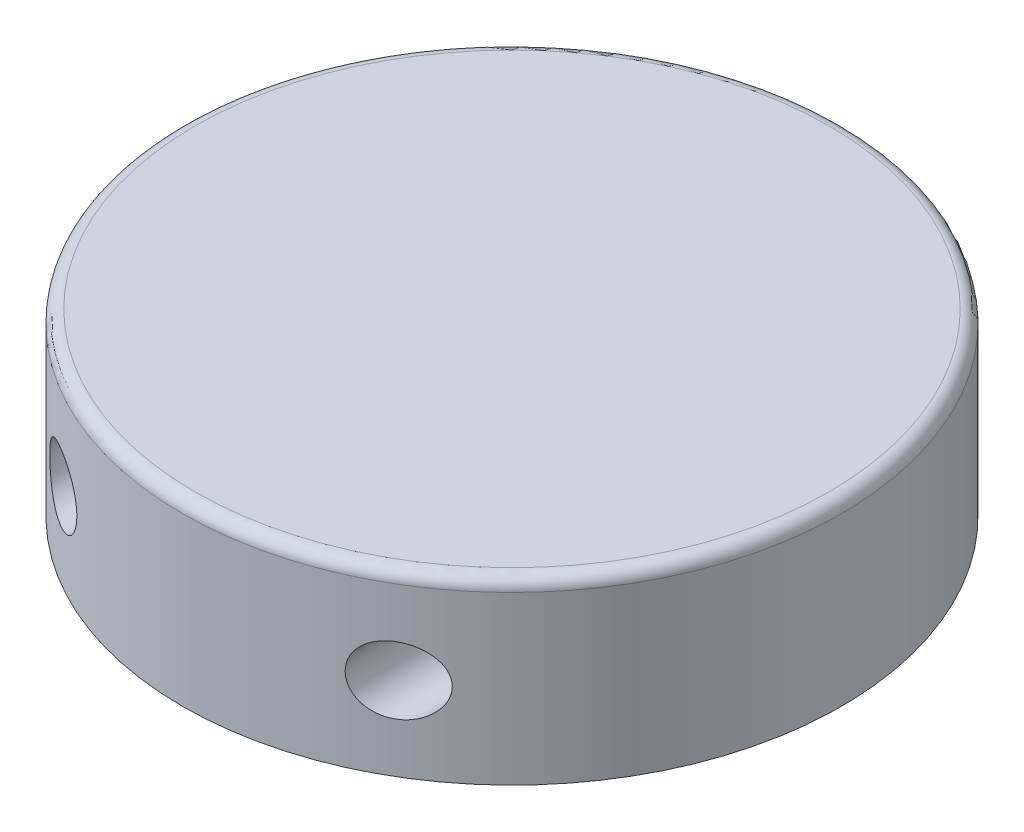
ISO-10303-21;
HEADER;
FILE_DESCRIPTION(('STEP AP214'),'2;1');
FILE_NAME('part.step','',(''),(''),'','','');
FILE_SCHEMA(('AUTOMOTIVE_DESIGN { 1 0 10303 214 1 1 1 1 }'));
ENDSEC;
DATA;
#1=APPLICATION_CONTEXT('core data for automotive mechanical design processes');
#2=APPLICATION_PROTOCOL_DEFINITION('international standard','automotive_design',2000,#1);
#3=PRODUCT_CONTEXT('',#1,'mechanical');
#4=PRODUCT('Part','Part','',(#3));
#5=PRODUCT_RELATED_PRODUCT_CATEGORY('part','',(#4));
#6=PRODUCT_DEFINITION_FORMATION('','',#4);
#7=PRODUCT_DEFINITION_CONTEXT('part definition',#1,'design');
#8=PRODUCT_DEFINITION('design','',#6,#7);
#9=PRODUCT_DEFINITION_SHAPE('','',#8);
#10=(LENGTH_UNIT() NAMED_UNIT(*) SI_UNIT(.MILLI.,.METRE.));
#11=(NAMED_UNIT(*) PLANE_ANGLE_UNIT() SI_UNIT($,.RADIAN.));
#12=(NAMED_UNIT(*) SI_UNIT($,.STERADIAN.) SOLID_ANGLE_UNIT());
#13=UNCERTAINTY_MEASURE_WITH_UNIT(LENGTH_MEASURE(1.E-05),#10,'distance_accuracy_value','');
#14=(GEOMETRIC_REPRESENTATION_CONTEXT(3) GLOBAL_UNCERTAINTY_ASSIGNED_CONTEXT((#13)) GLOBAL_UNIT_ASSIGNED_CONTEXT((#10,
#11,#12)) REPRESENTATION_CONTEXT('',''));
#15=CARTESIAN_POINT('',(0.,0.,0.));
#16=DIRECTION('',(0.,0.,1.));
#17=DIRECTION('',(1.,0.,0.));
#18=AXIS2_PLACEMENT_3D('',#15,#16,#17);
#19=CARTESIAN_POINT('',(0.,21.4,0.));
#20=DIRECTION('',(0.,-1.,0.));
#21=DIRECTION('',(0.,0.,-1.));
#22=AXIS2_PLACEMENT_3D('',#19,#20,#21);
#23=CYLINDRICAL_SURFACE('',#22,39.3);
#24=CARTESIAN_POINT('',(24.,9.94999999999997,31.1205719741781));
#25=CARTESIAN_POINT('',(24.0000004367337,9.75702235025103,31.1205716483451));
#26=CARTESIAN_POINT('',(23.9859498878768,9.56404571600808,31.1314224845735));
#27=CARTESIAN_POINT('',(23.9307323153177,9.18437149414656,31.1738868124886));
#28=CARTESIAN_POINT('',(23.889554633807,8.99767640475851,31.2055084646763));
#29=CARTESIAN_POINT('',(23.7829266022278,8.63670399423492,31.2868473359323));
#30=CARTESIAN_POINT('',(23.7175976432236,8.46236968013503,31.3364740337929));
#31=CARTESIAN_POINT('',(23.56591285891,8.12848015842301,31.4507032763606));
#32=CARTESIAN_POINT('',(23.4795504893609,7.9689295719222,31.5153104817342));
#33=CARTESIAN_POINT('',(23.2810537998613,7.65386834507642,31.6622644846472));
#34=CARTESIAN_POINT('',(23.1673608424185,7.49983155229876,31.7456474743854));
#35=CARTESIAN_POINT('',(22.9228514518291,7.21274960495519,31.9226517859381));
#36=CARTESIAN_POINT('',(22.7920271726797,7.0797141307694,32.016277795718));
#37=CARTESIAN_POINT('',(22.4886637812432,6.81065461097024,32.2302796034445));
#38=CARTESIAN_POINT('',(22.3130230727105,6.6793937134958,32.3522518750715));
#39=CARTESIAN_POINT('',(21.94598573118,6.44854278442323,32.6023487306357));
#40=CARTESIAN_POINT('',(21.7545776645915,6.34897599464994,32.7304777505384));
#41=CARTESIAN_POINT('',(21.3275209999802,6.16848395247953,33.0106375022933));
#42=CARTESIAN_POINT('',(21.0897588773783,6.09327668944546,33.1631480130952));
#43=CARTESIAN_POINT('',(20.6036253190854,5.98799899532425,33.4673383585911));
#44=CARTESIAN_POINT('',(20.3552486839697,5.95795095186154,33.6190177441569));
#45=CARTESIAN_POINT('',(19.9725838712759,5.94790055574151,33.8468582559754));
#46=CARTESIAN_POINT('',(19.8396864734694,5.95098780086743,33.9249249843817));
#47=CARTESIAN_POINT('',(19.573739423672,5.97054550202568,34.0790591570475));
#48=CARTESIAN_POINT('',(19.4406898587151,5.98701035463219,34.1551274246252));
#49=CARTESIAN_POINT('',(19.1754853954293,6.03358426834627,34.3047221863499));
#50=CARTESIAN_POINT('',(19.0433308395354,6.06369828204682,34.378247747445));
#51=CARTESIAN_POINT('',(18.7812618906078,6.13775619152729,34.5221164375005));
#52=CARTESIAN_POINT('',(18.6513462566428,6.18169214819713,34.5924613669044));
#53=CARTESIAN_POINT('',(18.403090890259,6.28031524591406,34.7251321387838));
#54=CARTESIAN_POINT('',(18.2845359828487,6.3341559146246,34.7876842490207));
#55=CARTESIAN_POINT('',(18.0518201313635,6.45404308371528,34.9090102518675));
#56=CARTESIAN_POINT('',(17.9376568140551,6.52008287641596,34.9677861969774));
#57=CARTESIAN_POINT('',(17.715029480331,6.66419947243356,35.0810964499967));
#58=CARTESIAN_POINT('',(17.6065629619296,6.74227093125897,35.1356326251172));
#59=CARTESIAN_POINT('',(17.3966771906184,6.91013825072774,35.2400249478298));
#60=CARTESIAN_POINT('',(17.2952568268871,6.9999322568638,35.2898818335456));
#61=CARTESIAN_POINT('',(17.1129078985375,7.17890877820417,35.3786286616791));
#62=CARTESIAN_POINT('',(17.0309955888393,7.26679676310176,35.4181125613419));
#63=CARTESIAN_POINT('',(16.8746549624477,7.45064549013117,35.4928658601843));
#64=CARTESIAN_POINT('',(16.8002255303775,7.54660502521217,35.5281358876201));
#65=CARTESIAN_POINT('',(16.6598301750251,7.74588712005912,35.5941860126814));
#66=CARTESIAN_POINT('',(16.5938592250628,7.84920524945849,35.6249687784863));
#67=CARTESIAN_POINT('',(16.4712229092875,8.0624474489991,35.6818355493655));
#68=CARTESIAN_POINT('',(16.4145565690073,8.1723708257268,35.7079200465151));
#69=CARTESIAN_POINT('',(16.3171344455011,8.38519331690116,35.752533659173));
#70=CARTESIAN_POINT('',(16.2753064246444,8.48749432657372,35.771582347638));
#71=CARTESIAN_POINT('',(16.2001015603304,8.69579534509265,35.8057036879036));
#72=CARTESIAN_POINT('',(16.1667238642029,8.80179497950456,35.8207767408674));
#73=CARTESIAN_POINT('',(16.1088299521118,9.01663562301356,35.8468493261039));
#74=CARTESIAN_POINT('',(16.0843105371636,9.12547559112743,35.8578503289485));
#75=CARTESIAN_POINT('',(16.0444189603798,9.34515368114454,35.875717412209));
#76=CARTESIAN_POINT('',(16.0290464721834,9.45599173161113,35.8825836401532));
#77=CARTESIAN_POINT('',(16.0083463654044,9.67138845944432,35.8918230870908));
#78=CARTESIAN_POINT('',(16.0024229313056,9.77587895581515,35.8944628533587));
#79=CARTESIAN_POINT('',(15.9987856528215,9.98506750787086,35.8960842204553));
#80=CARTESIAN_POINT('',(16.0010744970963,10.0897656203137,35.895064623226));
#81=CARTESIAN_POINT('',(16.0138399684754,10.2985058317393,35.88937137729));
#82=CARTESIAN_POINT('',(16.0243123199287,10.4025482446997,35.8846996367243));
#83=CARTESIAN_POINT('',(16.0533286748346,10.6093095676124,35.871728285886));
#84=CARTESIAN_POINT('',(16.0718756602008,10.7120279741747,35.8634273353634));
#85=CARTESIAN_POINT('',(16.1164701809595,10.9136783936685,35.843409104268));
#86=CARTESIAN_POINT('',(16.1423877682993,11.012644970687,35.8317509714357));
#87=CARTESIAN_POINT('',(16.2015639810518,11.2078991889282,35.8050327728986));
#88=CARTESIAN_POINT('',(16.2348252241386,11.3041858610725,35.7899714940845));
#89=CARTESIAN_POINT('',(16.3451337594465,11.5880000960856,35.7397981726284));
#90=CARTESIAN_POINT('',(16.4327499466903,11.7706785711117,35.6996771156622));
#91=CARTESIAN_POINT('',(16.6355260115283,12.1232214652335,35.6056461831859));
#92=CARTESIAN_POINT('',(16.7513931649307,12.2925790300543,35.5513792568576));
#93=CARTESIAN_POINT('',(17.0049978429257,12.6091553448522,35.4307738955639));
#94=CARTESIAN_POINT('',(17.1427405334429,12.7563688494633,35.3644326086877));
#95=CARTESIAN_POINT('',(17.4455511320463,13.035455861771,35.2160901602475));
#96=CARTESIAN_POINT('',(17.6118433547985,13.1655925902241,35.1333284721708));
#97=CARTESIAN_POINT('',(17.9587281337197,13.3962512310725,34.9572874761152));
#98=CARTESIAN_POINT('',(18.1393260825743,13.4967619075816,34.8640041962468));
#99=CARTESIAN_POINT('',(18.5285877848544,13.6763135902414,34.6588303591607));
#100=CARTESIAN_POINT('',(18.7382407173076,13.7521451393071,34.5460121515003));
#101=CARTESIAN_POINT('',(19.1628838342106,13.8676166385126,34.3122826126043));
#102=CARTESIAN_POINT('',(19.3778762597849,13.9072411185971,34.191367845642));
#103=CARTESIAN_POINT('',(19.8331708788641,13.9538002472475,33.9295143068437));
#104=CARTESIAN_POINT('',(20.07351691554,13.9564111346466,33.7878795024511));
#105=CARTESIAN_POINT('',(20.5488041126521,13.9193469252747,33.5009534082908));
#106=CARTESIAN_POINT('',(20.7837413224327,13.8796418627614,33.3556595986066));
#107=CARTESIAN_POINT('',(21.2638434376475,13.7539124791498,33.0518791894045));
#108=CARTESIAN_POINT('',(21.5080015434858,13.6640115305599,32.8933919704275));
#109=CARTESIAN_POINT('',(21.9771466624118,13.4369427129619,32.5818085680769));
#110=CARTESIAN_POINT('',(22.202138244206,13.2997861477747,32.4287111050862));
#111=CARTESIAN_POINT('',(22.5905118296975,13.0058701989524,32.1590606450284));
#112=CARTESIAN_POINT('',(22.757924195903,12.8561291827068,32.0406566967842));
#113=CARTESIAN_POINT('',(23.0690991625218,12.5252756655424,31.8173414739471));
#114=CARTESIAN_POINT('',(23.212892104453,12.3442040361057,31.712412927279));
#115=CARTESIAN_POINT('',(23.446847389397,11.9885953290825,31.5396978978216));
#116=CARTESIAN_POINT('',(23.5420090420954,11.8189512055665,31.468628912211));
#117=CARTESIAN_POINT('',(23.7082716798775,11.4623842719858,31.3435591699238));
#118=CARTESIAN_POINT('',(23.7793927375086,11.2754760433496,31.2895441766191));
#119=CARTESIAN_POINT('',(23.8898131319358,10.9012448013563,31.2053102193634));
#120=CARTESIAN_POINT('',(23.9308937589321,10.7147531592331,31.1737627971324));
#121=CARTESIAN_POINT('',(23.9859809503328,10.3355054558359,31.1313984502066));
#122=CARTESIAN_POINT('',(23.9999995637765,10.1427522213505,31.1205722996304));
#123=CARTESIAN_POINT('',(24.,9.94999999999997,31.1205719741781));
#124=B_SPLINE_CURVE_WITH_KNOTS('',3,(#24,#25,#26,#27,#28,#29,#30,#31,#32,#33,#34,#35,#36,#37,
#38,#39,#40,#41,#42,#43,#44,#45,#46,#47,#48,#49,#50,#51,#52,#53,#54,#55,#56,#57,#58,#59,#60,#61,
#62,#63,#64,#65,#66,#67,#68,#69,#70,#71,#72,#73,#74,#75,#76,#77,#78,#79,#80,#81,#82,#83,#84,#85,
#86,#87,#88,#89,#90,#91,#92,#93,#94,#95,#96,#97,#98,#99,#100,#101,#102,#103,#104,#105,#106,#107,
#108,#109,#110,#111,#112,#113,#114,#115,#116,#117,#118,#119,#120,#121,#122,#123),.UNSPECIFIED.,
.T.,.F.,(4,2,2,2,2,2,2,2,2,2,2,2,2,2,2,2,2,2,2,2,2,2,2,2,2,2,2,2,2,2,2,2,2,2,2,2,2,2,2,2,2,2,2,
2,2,2,2,2,2,4),(0.,0.578149471992341,1.15652622506883,1.73203456710251,2.30772219945241,
2.93192979410053,3.55642427708915,4.30630707215368,5.05673850885305,5.92998935051802,
6.80367296251658,7.2656598486744,7.72745332390251,8.18941449502801,8.65111080578781,
9.08386875035925,9.51638944777527,9.94871856943401,10.3809793793074,10.7598461833672,
11.1386564306074,11.5172405058395,11.8957849068196,12.2318047631017,12.5677907001704,
12.9036551813165,13.2395076781537,13.553201590839,13.8669982147617,14.1806309983518,
14.4943797030089,14.8029074965375,15.1115454440443,15.7282211415504,16.3622930865178,
16.9965149913174,17.6740957952512,18.3519332467425,19.0984869885765,19.8453595586123,
20.6788435549317,21.5129181694982,22.4226882178029,23.3322407946909,24.0910198056273,
24.8488163341647,25.4676210184011,26.0859077518268,26.6636391412548,27.2411132432772),.UNSPECIFIED.);
#125=CARTESIAN_POINT('',(24.,9.94999999999997,31.1205719741781));
#126=VERTEX_POINT('',#125);
#127=EDGE_CURVE('E35',#126,#126,#124,.T.);
#128=ORIENTED_EDGE('',*,*,#127,.T.);
#129=EDGE_LOOP('',(#128));
#130=FACE_BOUND('',#129,.T.);
#131=CARTESIAN_POINT('',(-16.,9.95,35.8955428988057));
#132=CARTESIAN_POINT('',(-15.9999997590268,9.8452241676736,35.8955429740728));
#133=CARTESIAN_POINT('',(-16.0041203515562,9.74045176538424,35.8937071436146));
#134=CARTESIAN_POINT('',(-16.0205593282236,9.53164235725571,35.8863729023838));
#135=CARTESIAN_POINT('',(-16.0328806404591,9.42760562750506,35.8808731834055));
#136=CARTESIAN_POINT('',(-16.0655807671828,9.22111987173641,35.8662436603464));
#137=CARTESIAN_POINT('',(-16.0859555719473,9.11867008194113,35.8571156627231));
#138=CARTESIAN_POINT('',(-16.1345493832768,8.91599969226433,35.8352762657919));
#139=CARTESIAN_POINT('',(-16.1627713782482,8.81577995737845,35.8225635012888));
#140=CARTESIAN_POINT('',(-16.2267034485003,8.61847337278842,35.793649191483));
#141=CARTESIAN_POINT('',(-16.2624000462627,8.52138124239186,35.7774539241133));
#142=CARTESIAN_POINT('',(-16.3409377601621,8.3307689568906,35.7416509631829));
#143=CARTESIAN_POINT('',(-16.3837815144312,8.23725013647683,35.7220420094578));
#144=CARTESIAN_POINT('',(-16.5223934258558,7.96301715940687,35.6582511230244));
#145=CARTESIAN_POINT('',(-16.6283033938818,7.78843997131337,35.60907782747));
#146=CARTESIAN_POINT('',(-16.86640588436,7.45524923736447,35.4969307822579));
#147=CARTESIAN_POINT('',(-16.9992658559993,7.29723813032526,35.4336012583432));
#148=CARTESIAN_POINT('',(-17.2845264952018,7.00589041134208,35.2953290462837));
#149=CARTESIAN_POINT('',(-17.4369320004669,6.87255992811248,35.2203834820997));
#150=CARTESIAN_POINT('',(-17.7693900964558,6.62268309348768,35.0539011446319));
#151=CARTESIAN_POINT('',(-17.9506809932971,6.50835610464575,34.9615139462921));
#152=CARTESIAN_POINT('',(-18.3248233851184,6.31152155102385,34.7668718240715));
#153=CARTESIAN_POINT('',(-18.5176797776453,6.22902757782599,34.6646127084723));
#154=CARTESIAN_POINT('',(-18.9312799955535,6.08857832093468,34.4406402100228));
#155=CARTESIAN_POINT('',(-19.1527726653748,6.03427653987141,34.3180211642214));
#156=CARTESIAN_POINT('',(-19.597819931862,5.96388942002956,34.0658334614784));
#157=CARTESIAN_POINT('',(-19.8213753592222,5.94782021837472,33.9362618936168));
#158=CARTESIAN_POINT('',(-20.290787292332,5.95292658298172,33.6579334111187));
#159=CARTESIAN_POINT('',(-20.5362980016612,5.97853222537199,33.5086670807192));
#160=CARTESIAN_POINT('',(-21.0179015174898,6.07389082605452,33.2087107346837));
#161=CARTESIAN_POINT('',(-21.2539860627186,6.14368164377712,33.0580196074133));
#162=CARTESIAN_POINT('',(-21.7269146054713,6.33240272033566,32.7492939886718));
#163=CARTESIAN_POINT('',(-21.9626856065747,6.4543930642128,32.5914708375228));
#164=CARTESIAN_POINT('',(-22.4097882739966,6.74624335531925,32.2856712236157));
#165=CARTESIAN_POINT('',(-22.621142736572,6.91605813397047,32.1376856318433));
#166=CARTESIAN_POINT('',(-22.9636175743543,7.25551823612834,31.8935007645904));
#167=CARTESIAN_POINT('',(-23.1017845127615,7.41528815125126,31.7934289202936));
#168=CARTESIAN_POINT('',(-23.3542570537494,7.76035712436593,31.6084338452837));
#169=CARTESIAN_POINT('',(-23.4685962945082,7.94561957152517,31.5234892839918));
#170=CARTESIAN_POINT('',(-23.65174074486,8.30717582102311,31.386241335142));
#171=CARTESIAN_POINT('',(-23.7249223513613,8.48005688531432,31.3308789989845));
#172=CARTESIAN_POINT('',(-23.8165845199701,8.74888271207731,31.2611861863408));
#173=CARTESIAN_POINT('',(-23.844125644384,8.84010362900811,31.2401761442257));
#174=CARTESIAN_POINT('',(-23.8927953579865,9.02518425010417,31.2029689816648));
#175=CARTESIAN_POINT('',(-23.9139266084386,9.119042841421,31.186769863869));
#176=CARTESIAN_POINT('',(-23.9495439526221,9.30928088950401,31.15942637837));
#177=CARTESIAN_POINT('',(-23.9639931005196,9.40567131936796,31.1483101178774));
#178=CARTESIAN_POINT('',(-23.9858248023284,9.59968052915269,31.1315017242336));
#179=CARTESIAN_POINT('',(-23.9932103925649,9.69729876299313,31.1258072604856));
#180=CARTESIAN_POINT('',(-24.0007919758527,9.89298179341872,31.1199615648758));
#181=CARTESIAN_POINT('',(-24.0009878732636,9.99104659592695,31.1198104067535));
#182=CARTESIAN_POINT('',(-23.9941867332155,10.1867717114217,31.1250545581334));
#183=CARTESIAN_POINT('',(-23.9871901110963,10.2844320474377,31.1304495473674));
#184=CARTESIAN_POINT('',(-23.9670163841337,10.4703583702251,31.145983242021));
#185=CARTESIAN_POINT('',(-23.9544088355226,10.5587234096677,31.1556846190009));
#186=CARTESIAN_POINT('',(-23.9234540584677,10.7338555762378,31.1794599200386));
#187=CARTESIAN_POINT('',(-23.9051049032513,10.8206221565881,31.1935353119209));
#188=CARTESIAN_POINT('',(-23.8418034686287,11.0776556197208,31.2419793212755));
#189=CARTESIAN_POINT('',(-23.7885802291006,11.2448079774847,31.2825789980546));
#190=CARTESIAN_POINT('',(-23.6595059569021,11.5751394769483,31.3803217236845));
#191=CARTESIAN_POINT('',(-23.5826601080023,11.7377062699671,31.4381879060522));
#192=CARTESIAN_POINT('',(-23.4106241754608,12.0473902474425,31.566504238692));
#193=CARTESIAN_POINT('',(-23.3154258654073,12.194500457692,31.6369600311634));
#194=CARTESIAN_POINT('',(-23.0926464677439,12.4948022217316,31.8000263779702));
#195=CARTESIAN_POINT('',(-22.9623142183741,12.6450016721065,31.8943745520976));
#196=CARTESIAN_POINT('',(-22.6847111766128,12.9216643895771,32.0924137144742));
#197=CARTESIAN_POINT('',(-22.5374293015192,13.0481119824119,32.1961108059105));
#198=CARTESIAN_POINT('',(-22.1989355010781,13.2992332091225,32.4306558976864));
#199=CARTESIAN_POINT('',(-22.0047733816675,13.4186936790644,32.5628397812804));
#200=CARTESIAN_POINT('',(-21.6015814255864,13.6223290110125,32.8316999034053));
#201=CARTESIAN_POINT('',(-21.3925418013529,13.7064803882694,32.9683790668774));
#202=CARTESIAN_POINT('',(-20.9339068922711,13.8478396848077,33.2617724639513));
#203=CARTESIAN_POINT('',(-20.6827218536969,13.8996519593967,33.4186219853555));
#204=CARTESIAN_POINT('',(-20.17268648017,13.9544838533758,33.7289439402963));
#205=CARTESIAN_POINT('',(-19.9138334203867,13.9574859145432,33.8824151387434));
#206=CARTESIAN_POINT('',(-19.5230245434659,13.9236768459091,34.1081369981305));
#207=CARTESIAN_POINT('',(-19.3909578094257,13.905629536593,34.1833819674401));
#208=CARTESIAN_POINT('',(-19.127919102916,13.8560671263425,34.3312596902795));
#209=CARTESIAN_POINT('',(-18.996946640993,13.8245584160988,34.4038936656409));
#210=CARTESIAN_POINT('',(-18.7372752314352,13.747875975991,34.5460048092086));
#211=CARTESIAN_POINT('',(-18.6085766663026,13.7026999698226,34.6154814493382));
#212=CARTESIAN_POINT('',(-18.3548889447417,13.5986147053033,34.7506645445328));
#213=CARTESIAN_POINT('',(-18.2298975446923,13.5397139527532,34.8163733034107));
#214=CARTESIAN_POINT('',(-17.9957658188257,13.4139752012455,34.9379201665303));
#215=CARTESIAN_POINT('',(-17.8861961207279,13.3482845792796,34.9941186993216));
#216=CARTESIAN_POINT('',(-17.6725725432267,13.2056965019734,35.1024858626098));
#217=CARTESIAN_POINT('',(-17.5685155542712,13.1288054582453,35.1546567727268));
#218=CARTESIAN_POINT('',(-17.3671692039451,12.9641511177057,35.2545608813468));
#219=CARTESIAN_POINT('',(-17.26987656358,12.8763931467908,35.3022962338005));
#220=CARTESIAN_POINT('',(-17.0833088767408,12.690483005975,35.3929557291461));
#221=CARTESIAN_POINT('',(-16.9940326266389,12.592332401324,35.4358805945536));
#222=CARTESIAN_POINT('',(-16.8355067607713,12.399396082961,35.5114407322839));
#223=CARTESIAN_POINT('',(-16.7651525181401,12.3057563583906,35.5446907165828));
#224=CARTESIAN_POINT('',(-16.6323839157283,12.1117069629072,35.6070103182686));
#225=CARTESIAN_POINT('',(-16.5699684361678,12.0112982498387,35.6360805252977));
#226=CARTESIAN_POINT('',(-16.4538865693652,11.8044904344524,35.689826414825));
#227=CARTESIAN_POINT('',(-16.4002160325603,11.6980942057057,35.7145041820963));
#228=CARTESIAN_POINT('',(-16.3023011586262,11.4801285834805,35.7593047926747));
#229=CARTESIAN_POINT('',(-16.2580561870312,11.3685595388175,35.7794279425738));
#230=CARTESIAN_POINT('',(-16.1829520576759,11.1509343810072,35.8134557654775));
#231=CARTESIAN_POINT('',(-16.1512726959219,11.0452205533894,35.8277446115374));
#232=CARTESIAN_POINT('',(-16.0966733210929,10.8310534774523,35.8523082461964));
#233=CARTESIAN_POINT('',(-16.0737563218202,10.7225993002424,35.862581653718));
#234=CARTESIAN_POINT('',(-16.0369912904516,10.503936326009,35.8790372857185));
#235=CARTESIAN_POINT('',(-16.0231369713782,10.3937287998023,35.8852223464035));
#236=CARTESIAN_POINT('',(-16.0046397655823,10.1723464549534,35.8934758675689));
#237=CARTESIAN_POINT('',(-16.000000255682,10.0611712967006,35.8955428189443));
#238=CARTESIAN_POINT('',(-16.,9.95,35.8955428988057));
#239=B_SPLINE_CURVE_WITH_KNOTS('',3,(#131,#132,#133,#134,#135,#136,#137,#138,#139,#140,#141,
#142,#143,#144,#145,#146,#147,#148,#149,#150,#151,#152,#153,#154,#155,#156,#157,#158,#159,#160,
#161,#162,#163,#164,#165,#166,#167,#168,#169,#170,#171,#172,#173,#174,#175,#176,#177,#178,#179,
#180,#181,#182,#183,#184,#185,#186,#187,#188,#189,#190,#191,#192,#193,#194,#195,#196,#197,#198,
#199,#200,#201,#202,#203,#204,#205,#206,#207,#208,#209,#210,#211,#212,#213,#214,#215,#216,#217,
#218,#219,#220,#221,#222,#223,#224,#225,#226,#227,#228,#229,#230,#231,#232,#233,#234,#235,#236,
#237,#238),.UNSPECIFIED.,.T.,.F.,(4,2,2,2,2,2,2,2,2,2,2,2,2,2,2,2,2,2,2,2,2,2,2,2,2,2,2,2,2,2,2,
2,2,2,2,2,2,2,2,2,2,2,2,2,2,2,2,2,2,2,2,2,2,4),(0.,0.314224840128568,0.628561935638139,
0.942742723752898,1.25704332403378,1.57078201254982,1.88463676441975,2.51175892594269,
3.15689119248138,3.80218344455805,4.49949297354393,5.1970999007053,5.97072423722214,
6.74467504553067,7.60638953948094,8.46884338218571,9.39084447615308,10.311977674553,
11.0105182444218,11.7080658841732,12.2925612133865,12.5849811880133,12.8772795884662,
13.1711753546901,13.4649447306695,13.7587180144911,14.0524743350103,14.3215140964364,
14.5906442394299,15.1284501597711,15.6930371976354,16.2578779001295,16.9157901868636,
17.5741351275752,18.3616163913344,19.1496205967762,20.0475424097216,20.9457872198704,
21.4044730254817,21.8629413152867,22.3214860056075,22.7797472688509,23.1978627377922,
23.6157397929201,24.0334128505317,24.451023091033,24.8157858498291,25.1804971008502,
25.5450347855477,25.9095479242512,26.2429478231615,26.5764622915645,26.9097451477034,
27.2431501148317),.UNSPECIFIED.);
#240=CARTESIAN_POINT('',(-16.,9.95,35.8955428988057));
#241=VERTEX_POINT('',#240);
#242=EDGE_CURVE('E50',#241,#241,#239,.T.);
#243=ORIENTED_EDGE('',*,*,#242,.T.);
#244=EDGE_LOOP('',(#243));
#245=FACE_BOUND('',#244,.T.);
#246=CARTESIAN_POINT('',(0.,19.9,0.));
#247=DIRECTION('',(0.,1.,0.));
#248=DIRECTION('',(0.,0.,1.));
#249=AXIS2_PLACEMENT_3D('',#246,#247,#248);
#250=CIRCLE('',#249,39.3);
#251=CARTESIAN_POINT('',(0.,19.9,39.3));
#252=VERTEX_POINT('',#251);
#253=EDGE_CURVE('E10',#252,#252,#250,.F.);
#254=ORIENTED_EDGE('',*,*,#253,.T.);
#255=EDGE_LOOP('',(#254));
#256=FACE_BOUND('',#255,.T.);
#257=CARTESIAN_POINT('',(0.,0.,0.));
#258=DIRECTION('',(0.,1.,0.));
#259=DIRECTION('',(0.,0.,1.));
#260=AXIS2_PLACEMENT_3D('',#257,#258,#259);
#261=CIRCLE('',#260,39.3);
#262=CARTESIAN_POINT('',(0.,0.,39.3));
#263=VERTEX_POINT('',#262);
#264=EDGE_CURVE('E47',#263,#263,#261,.T.);
#265=ORIENTED_EDGE('',*,*,#264,.T.);
#266=EDGE_LOOP('',(#265));
#267=FACE_BOUND('',#266,.T.);
#268=ADVANCED_FACE('F31',(#130,#245,#256,#267),#23,.T.);
#269=CARTESIAN_POINT('',(0.,21.4,0.));
#270=DIRECTION('',(0.,1.,0.));
#271=DIRECTION('',(0.,0.,1.));
#272=AXIS2_PLACEMENT_3D('',#269,#270,#271);
#273=PLANE('',#272);
#274=CARTESIAN_POINT('',(0.,21.4,0.));
#275=DIRECTION('',(0.,1.,0.));
#276=DIRECTION('',(0.,0.,1.));
#277=AXIS2_PLACEMENT_3D('',#274,#275,#276);
#278=CIRCLE('',#277,37.8);
#279=CARTESIAN_POINT('',(0.,21.4,37.8));
#280=VERTEX_POINT('',#279);
#281=EDGE_CURVE('E42',#280,#280,#278,.T.);
#282=ORIENTED_EDGE('',*,*,#281,.T.);
#283=EDGE_LOOP('',(#282));
#284=FACE_BOUND('',#283,.T.);
#285=ADVANCED_FACE('F65',(#284),#273,.T.);
#286=CARTESIAN_POINT('',(0.,0.,0.));
#287=DIRECTION('',(0.,1.,0.));
#288=DIRECTION('',(0.,0.,1.));
#289=AXIS2_PLACEMENT_3D('',#286,#287,#288);
#290=PLANE('',#289);
#291=ORIENTED_EDGE('',*,*,#264,.F.);
#292=EDGE_LOOP('',(#291));
#293=FACE_BOUND('',#292,.T.);
#294=ADVANCED_FACE('F67',(#293),#290,.F.);
#295=CARTESIAN_POINT('',(0.,19.9,0.));
#296=DIRECTION('',(0.,1.,0.));
#297=DIRECTION('',(0.,0.,1.));
#298=AXIS2_PLACEMENT_3D('',#295,#296,#297);
#299=TOROIDAL_SURFACE('',#298,37.8,1.5);
#300=ORIENTED_EDGE('',*,*,#253,.F.);
#301=EDGE_LOOP('',(#300));
#302=FACE_BOUND('',#301,.T.);
#303=ORIENTED_EDGE('',*,*,#281,.F.);
#304=EDGE_LOOP('',(#303));
#305=FACE_BOUND('',#304,.T.);
#306=ADVANCED_FACE('F33',(#302,#305),#299,.T.);
#307=CARTESIAN_POINT('',(-20.,9.95,-10.7));
#308=DIRECTION('',(0.,0.,1.));
#309=DIRECTION('',(1.,0.,0.));
#310=AXIS2_PLACEMENT_3D('',#307,#308,#309);
#311=CYLINDRICAL_SURFACE('',#310,4.);
#312=CARTESIAN_POINT('',(-20.,9.95,-10.7));
#313=DIRECTION('',(0.,0.,1.));
#314=DIRECTION('',(1.,0.,0.));
#315=AXIS2_PLACEMENT_3D('',#312,#313,#314);
#316=CIRCLE('',#315,4.);
#317=CARTESIAN_POINT('',(-16.,9.95,-10.7));
#318=VERTEX_POINT('',#317);
#319=EDGE_CURVE('E55',#318,#318,#316,.T.);
#320=ORIENTED_EDGE('',*,*,#319,.F.);
#321=EDGE_LOOP('',(#320));
#322=FACE_BOUND('',#321,.T.);
#323=ORIENTED_EDGE('',*,*,#242,.F.);
#324=EDGE_LOOP('',(#323));
#325=FACE_BOUND('',#324,.T.);
#326=ADVANCED_FACE('F58',(#322,#325),#311,.F.);
#327=CARTESIAN_POINT('',(-20.,9.95,-10.7));
#328=DIRECTION('',(0.,0.,1.));
#329=DIRECTION('',(1.,0.,0.));
#330=AXIS2_PLACEMENT_3D('',#327,#328,#329);
#331=PLANE('',#330);
#332=ORIENTED_EDGE('',*,*,#319,.T.);
#333=EDGE_LOOP('',(#332));
#334=FACE_BOUND('',#333,.T.);
#335=ADVANCED_FACE('F63',(#334),#331,.T.);
#336=CARTESIAN_POINT('',(20.,9.94999999999997,-10.7));
#337=DIRECTION('',(0.,0.,1.));
#338=DIRECTION('',(1.,0.,0.));
#339=AXIS2_PLACEMENT_3D('',#336,#337,#338);
#340=CYLINDRICAL_SURFACE('',#339,4.);
#341=CARTESIAN_POINT('',(20.,9.94999999999997,-10.7));
#342=DIRECTION('',(0.,0.,1.));
#343=DIRECTION('',(-1.,0.,0.));
#344=AXIS2_PLACEMENT_3D('',#341,#342,#343);
#345=CIRCLE('',#344,4.);
#346=CARTESIAN_POINT('',(16.,9.94999999999997,-10.7));
#347=VERTEX_POINT('',#346);
#348=EDGE_CURVE('E89',#347,#347,#345,.T.);
#349=ORIENTED_EDGE('',*,*,#348,.F.);
#350=EDGE_LOOP('',(#349));
#351=FACE_BOUND('',#350,.T.);
#352=ORIENTED_EDGE('',*,*,#127,.F.);
#353=EDGE_LOOP('',(#352));
#354=FACE_BOUND('',#353,.T.);
#355=ADVANCED_FACE('F95',(#351,#354),#340,.F.);
#356=CARTESIAN_POINT('',(20.,9.94999999999997,-10.7));
#357=DIRECTION('',(0.,0.,-1.));
#358=DIRECTION('',(-1.,0.,0.));
#359=AXIS2_PLACEMENT_3D('',#356,#357,#358);
#360=PLANE('',#359);
#361=ORIENTED_EDGE('',*,*,#348,.T.);
#362=EDGE_LOOP('',(#361));
#363=FACE_BOUND('',#362,.T.);
#364=ADVANCED_FACE('F93',(#363),#360,.F.);
#365=CLOSED_SHELL('',(#268,#285,#294,#306,#326,#335,#355,#364));
#366=MANIFOLD_SOLID_BREP('B2',#365);
#367=ADVANCED_BREP_SHAPE_REPRESENTATION('',(#18,#366),#14);
#368=SHAPE_DEFINITION_REPRESENTATION(#9,#367);
ENDSEC;
END-ISO-10303-21;
